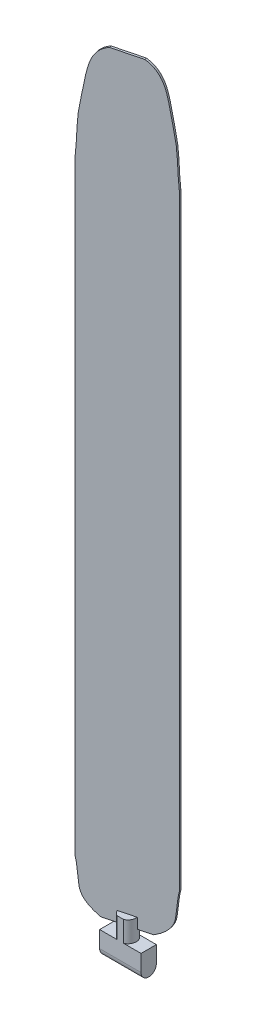
ISO-10303-21;
HEADER;
FILE_DESCRIPTION(('STEP AP214'),'2;1');
FILE_NAME('part.step','',(''),(''),'','','');
FILE_SCHEMA(('AUTOMOTIVE_DESIGN { 1 0 10303 214 1 1 1 1 }'));
ENDSEC;
DATA;
#1=APPLICATION_CONTEXT('core data for automotive mechanical design processes');
#2=APPLICATION_PROTOCOL_DEFINITION('international standard','automotive_design',2000,#1);
#3=PRODUCT_CONTEXT('',#1,'mechanical');
#4=PRODUCT('Part','Part','',(#3));
#5=PRODUCT_RELATED_PRODUCT_CATEGORY('part','',(#4));
#6=PRODUCT_DEFINITION_FORMATION('','',#4);
#7=PRODUCT_DEFINITION_CONTEXT('part definition',#1,'design');
#8=PRODUCT_DEFINITION('design','',#6,#7);
#9=PRODUCT_DEFINITION_SHAPE('','',#8);
#10=(LENGTH_UNIT() NAMED_UNIT(*) SI_UNIT(.MILLI.,.METRE.));
#11=(NAMED_UNIT(*) PLANE_ANGLE_UNIT() SI_UNIT($,.RADIAN.));
#12=(NAMED_UNIT(*) SI_UNIT($,.STERADIAN.) SOLID_ANGLE_UNIT());
#13=UNCERTAINTY_MEASURE_WITH_UNIT(LENGTH_MEASURE(1.E-05),#10,'distance_accuracy_value','');
#14=(GEOMETRIC_REPRESENTATION_CONTEXT(3) GLOBAL_UNCERTAINTY_ASSIGNED_CONTEXT((#13)) GLOBAL_UNIT_ASSIGNED_CONTEXT((#10,
#11,#12)) REPRESENTATION_CONTEXT('',''));
#15=CARTESIAN_POINT('',(0.,0.,0.));
#16=DIRECTION('',(0.,0.,1.));
#17=DIRECTION('',(1.,0.,0.));
#18=AXIS2_PLACEMENT_3D('',#15,#16,#17);
#19=CARTESIAN_POINT('',(-9.22789943202163,76.5175024074727,26.2388194762777));
#20=DIRECTION('',(0.248470646512677,0.,0.968639426113542));
#21=DIRECTION('',(0.968639426113542,0.,-0.248470646512677));
#22=AXIS2_PLACEMENT_3D('',#19,#20,#21);
#23=PLANE('',#22);
#24=CARTESIAN_POINT('',(-39.4032494334501,76.5175024074727,33.9792526255705));
#25=CARTESIAN_POINT('',(-42.2544679307018,78.055965616335,34.7106332448826));
#26=CARTESIAN_POINT('',(-47.1455859026863,81.6398276224077,35.9652788972332));
#27=CARTESIAN_POINT('',(-49.325736383886,96.7002340279113,36.5245204322718));
#28=CARTESIAN_POINT('',(-48.0147271567533,110.118902786004,36.1882267594479));
#29=CARTESIAN_POINT('',(-68.1428359658695,100.301631033117,41.3513907542741));
#30=B_SPLINE_CURVE_WITH_KNOTS('',3,(#24,#25,#26,#27,#28,#29),.UNSPECIFIED.,.F.,.F.,(4,1,1,4),
(0.,0.237372493603984,0.354242691382923,1.),.UNSPECIFIED.);
#31=CARTESIAN_POINT('',(-39.4032494334501,76.5175024074727,33.9792526255705));
#32=VERTEX_POINT('',#31);
#33=CARTESIAN_POINT('',(-49.2278994320217,98.1796978103091,36.4994237760474));
#34=VERTEX_POINT('',#33);
#35=EDGE_CURVE('E170',#32,#34,#30,.T.);
#36=ORIENTED_EDGE('',*,*,#35,.F.);
#37=DIRECTION('',(0.968639426113542,0.,-0.248470646512677));
#38=VECTOR('',#37,1.);
#39=CARTESIAN_POINT('',(-9.22789943202163,76.5175024074727,26.2388194762777));
#40=LINE('',#39,#38);
#41=CARTESIAN_POINT('',(-33.0720679794048,76.5175024074727,32.3552089343205));
#42=VERTEX_POINT('',#41);
#43=EDGE_CURVE('E426',#32,#42,#40,.T.);
#44=ORIENTED_EDGE('',*,*,#43,.T.);
#45=DIRECTION('',(0.,-1.,0.));
#46=VECTOR('',#45,1.);
#47=CARTESIAN_POINT('',(-33.0720679794048,81.5175024074727,32.3552089343205));
#48=LINE('',#47,#46);
#49=CARTESIAN_POINT('',(-33.0720679794048,81.5175024074727,32.3552089343205));
#50=VERTEX_POINT('',#49);
#51=EDGE_CURVE('E205',#50,#42,#48,.T.);
#52=ORIENTED_EDGE('',*,*,#51,.F.);
#53=DIRECTION('',(0.968639426113542,0.,-0.248470646512677));
#54=VECTOR('',#53,1.);
#55=CARTESIAN_POINT('',(-44.923581978201,81.5175024074727,35.3953013216912));
#56=LINE('',#55,#54);
#57=CARTESIAN_POINT('',(-25.3837308846385,81.5175024074727,30.3830343180046));
#58=VERTEX_POINT('',#57);
#59=EDGE_CURVE('E253',#50,#58,#56,.T.);
#60=ORIENTED_EDGE('',*,*,#59,.T.);
#61=DIRECTION('',(0.,-1.,0.));
#62=VECTOR('',#61,1.);
#63=CARTESIAN_POINT('',(-25.3837308846385,81.5175024074727,30.3830343180046));
#64=LINE('',#63,#62);
#65=CARTESIAN_POINT('',(-25.3837308846385,76.5175024074727,30.3830343180046));
#66=VERTEX_POINT('',#65);
#67=EDGE_CURVE('E208',#66,#58,#64,.F.);
#68=ORIENTED_EDGE('',*,*,#67,.F.);
#69=CARTESIAN_POINT('',(-19.0525494305926,76.5175024074727,28.7589906267544));
#70=VERTEX_POINT('',#69);
#71=EDGE_CURVE('E424',#66,#70,#40,.T.);
#72=ORIENTED_EDGE('',*,*,#71,.T.);
#73=CARTESIAN_POINT('',(-19.0525494305931,76.5175024074727,28.7589906267545));
#74=CARTESIAN_POINT('',(-16.2013309333414,78.055965616335,28.0276100074424));
#75=CARTESIAN_POINT('',(-11.3102129613569,81.6398276224077,26.7729643550918));
#76=CARTESIAN_POINT('',(-9.13006248015724,96.7002340279113,26.2137228200533));
#77=CARTESIAN_POINT('',(-10.4410717072898,110.118902786004,26.5500164928771));
#78=CARTESIAN_POINT('',(9.68703710182626,100.301631033117,21.3868524980509));
#79=B_SPLINE_CURVE_WITH_KNOTS('',3,(#73,#74,#75,#76,#77,#78),.UNSPECIFIED.,.F.,.F.,(4,1,1,4),
(0.,0.237372493603984,0.354242691382923,1.),.UNSPECIFIED.);
#80=CARTESIAN_POINT('',(-9.22789943202163,98.1796978103093,26.2388194762777));
#81=VERTEX_POINT('',#80);
#82=EDGE_CURVE('E282',#70,#81,#79,.T.);
#83=ORIENTED_EDGE('',*,*,#82,.T.);
#84=DIRECTION('',(0.,1.,0.));
#85=VECTOR('',#84,1.);
#86=CARTESIAN_POINT('',(-9.22789943202163,76.5175024074727,26.2388194762777));
#87=LINE('',#86,#85);
#88=CARTESIAN_POINT('',(-9.22789943202163,391.692905165415,26.2388194762777));
#89=VERTEX_POINT('',#88);
#90=EDGE_CURVE('E194',#81,#89,#87,.T.);
#91=ORIENTED_EDGE('',*,*,#90,.T.);
#92=CARTESIAN_POINT('',(-22.4734075021756,441.517502407473,29.6364924027091));
#93=CARTESIAN_POINT('',(-14.5906004465754,438.230583610108,27.6144333034854));
#94=CARTESIAN_POINT('',(-13.2737519900424,425.112937890694,27.2766417801042));
#95=CARTESIAN_POINT('',(-8.66340105974158,403.698342108845,26.0940171156319));
#96=CARTESIAN_POINT('',(-10.6080017756583,388.609679434815,26.5928365773087));
#97=CARTESIAN_POINT('',(-5.85636432012996,378.744136091539,25.3739697846302));
#98=B_SPLINE_CURVE_WITH_KNOTS('',3,(#92,#93,#94,#95,#96,#97),.UNSPECIFIED.,.F.,.F.,(4,1,1,4),
(0.,0.351967415580605,0.52313711086821,1.),.UNSPECIFIED.);
#99=CARTESIAN_POINT('',(-22.4734075021753,441.517502407473,29.636492402709));
#100=VERTEX_POINT('',#99);
#101=EDGE_CURVE('E277',#100,#89,#98,.T.);
#102=ORIENTED_EDGE('',*,*,#101,.F.);
#103=DIRECTION('',(0.968639426113542,0.,-0.248470646512677));
#104=VECTOR('',#103,1.);
#105=CARTESIAN_POINT('',(-9.22789943202163,441.517502407473,26.2388194762777));
#106=LINE('',#105,#104);
#107=CARTESIAN_POINT('',(-35.9823913618677,441.517502407473,33.101750849616));
#108=VERTEX_POINT('',#107);
#109=EDGE_CURVE('E428',#108,#100,#106,.T.);
#110=ORIENTED_EDGE('',*,*,#109,.F.);
#111=CARTESIAN_POINT('',(-35.9823913618677,441.517502407473,33.101750849616));
#112=CARTESIAN_POINT('',(-43.8651984174679,438.230583610108,35.1238099488397));
#113=CARTESIAN_POINT('',(-45.1820468740009,425.112937890694,35.4616014722208));
#114=CARTESIAN_POINT('',(-49.7923978043017,403.698342108845,36.6442261366931));
#115=CARTESIAN_POINT('',(-47.8477970883849,388.609679434815,36.1454066750164));
#116=CARTESIAN_POINT('',(-52.5994345439133,378.744136091539,37.3642734676949));
#117=B_SPLINE_CURVE_WITH_KNOTS('',3,(#111,#112,#113,#114,#115,#116),.UNSPECIFIED.,.F.,.F.,(4,1,
1,4),(0.,0.351967415580605,0.52313711086821,1.),.UNSPECIFIED.);
#118=CARTESIAN_POINT('',(-49.2278994320217,391.692905165415,36.4994237760474));
#119=VERTEX_POINT('',#118);
#120=EDGE_CURVE('E433',#108,#119,#117,.T.);
#121=ORIENTED_EDGE('',*,*,#120,.T.);
#122=DIRECTION('',(0.,1.,0.));
#123=VECTOR('',#122,1.);
#124=CARTESIAN_POINT('',(-49.2278994320217,76.5175024074727,36.4994237760474));
#125=LINE('',#124,#123);
#126=EDGE_CURVE('E189',#34,#119,#125,.T.);
#127=ORIENTED_EDGE('',*,*,#126,.F.);
#128=EDGE_LOOP('',(#36,#44,#52,#60,#68,#72,#83,#91,#102,#110,#121,#127));
#129=FACE_BOUND('',#128,.T.);
#130=ADVANCED_FACE('F33',(#129),#23,.T.);
#131=CARTESIAN_POINT('',(-49.4763700785343,76.5175024074727,35.5307843499338));
#132=DIRECTION('',(-0.248470646512674,0.,-0.968639426113543));
#133=DIRECTION('',(-0.968639426113543,0.,0.248470646512674));
#134=AXIS2_PLACEMENT_3D('',#131,#132,#133);
#135=PLANE('',#134);
#136=CARTESIAN_POINT('',(-39.6517200799627,76.5175024074727,33.0106131994569));
#137=CARTESIAN_POINT('',(-42.5029385772145,78.055965616335,33.7419938187691));
#138=CARTESIAN_POINT('',(-47.394056549199,81.6398276224077,34.9966394711197));
#139=CARTESIAN_POINT('',(-49.5742070303987,96.7002340279113,35.5558810061582));
#140=CARTESIAN_POINT('',(-48.263197803266,110.118902786004,35.2195873333344));
#141=CARTESIAN_POINT('',(-68.3913066123821,100.301631033117,40.3827513281606));
#142=B_SPLINE_CURVE_WITH_KNOTS('',3,(#136,#137,#138,#139,#140,#141),.UNSPECIFIED.,.F.,.F.,(4,1,
1,4),(0.,0.237372493603984,0.354242691382923,1.),.UNSPECIFIED.);
#143=CARTESIAN_POINT('',(-49.4763700785343,98.1796978103091,35.5307843499338));
#144=VERTEX_POINT('',#143);
#145=CARTESIAN_POINT('',(-39.6517200799627,76.5175024074727,33.010613199457));
#146=VERTEX_POINT('',#145);
#147=EDGE_CURVE('E47',#144,#146,#142,.F.);
#148=ORIENTED_EDGE('',*,*,#147,.F.);
#149=DIRECTION('',(0.,1.,0.));
#150=VECTOR('',#149,1.);
#151=CARTESIAN_POINT('',(-49.4763700785343,76.5175024074727,35.5307843499338));
#152=LINE('',#151,#150);
#153=CARTESIAN_POINT('',(-49.4763700785343,391.692905165415,35.5307843499338));
#154=VERTEX_POINT('',#153);
#155=EDGE_CURVE('E179',#144,#154,#152,.T.);
#156=ORIENTED_EDGE('',*,*,#155,.T.);
#157=CARTESIAN_POINT('',(-36.2308620083804,441.517502407473,32.1331114235024));
#158=CARTESIAN_POINT('',(-44.1136690639806,438.230583610108,34.1551705227261));
#159=CARTESIAN_POINT('',(-45.4305175205135,425.112937890694,34.4929620461073));
#160=CARTESIAN_POINT('',(-50.0408684508144,403.698342108845,35.6755867105796));
#161=CARTESIAN_POINT('',(-48.0962677348976,388.609679434815,35.1767672489028));
#162=CARTESIAN_POINT('',(-52.847905190426,378.744136091539,36.3956340415813));
#163=B_SPLINE_CURVE_WITH_KNOTS('',3,(#157,#158,#159,#160,#161,#162),.UNSPECIFIED.,.F.,.F.,(4,1,
1,4),(0.,0.351967415580605,0.52313711086821,1.),.UNSPECIFIED.);
#164=CARTESIAN_POINT('',(-36.2308620083808,441.517502407473,32.1331114235026));
#165=VERTEX_POINT('',#164);
#166=EDGE_CURVE('E437',#154,#165,#163,.F.);
#167=ORIENTED_EDGE('',*,*,#166,.T.);
#168=DIRECTION('',(-0.968639426113543,0.,0.248470646512674));
#169=VECTOR('',#168,1.);
#170=CARTESIAN_POINT('',(-49.4763700785343,441.517502407473,35.5307843499338));
#171=LINE('',#170,#169);
#172=CARTESIAN_POINT('',(-22.7218781486879,441.517502407473,28.6678529765955));
#173=VERTEX_POINT('',#172);
#174=EDGE_CURVE('E274',#173,#165,#171,.T.);
#175=ORIENTED_EDGE('',*,*,#174,.F.);
#176=CARTESIAN_POINT('',(-22.7218781486883,441.517502407473,28.6678529765955));
#177=CARTESIAN_POINT('',(-14.8390710930881,438.230583610108,26.6457938773719));
#178=CARTESIAN_POINT('',(-13.5222226365551,425.112937890694,26.3080023539907));
#179=CARTESIAN_POINT('',(-8.91187170625425,403.698342108845,25.1253776895184));
#180=CARTESIAN_POINT('',(-10.856472422171,388.609679434815,25.6241971511952));
#181=CARTESIAN_POINT('',(-6.10483496664264,378.744136091539,24.4053303585166));
#182=B_SPLINE_CURVE_WITH_KNOTS('',3,(#176,#177,#178,#179,#180,#181),.UNSPECIFIED.,.F.,.F.,(4,1,
1,4),(0.,0.351967415580605,0.52313711086821,1.),.UNSPECIFIED.);
#183=CARTESIAN_POINT('',(-9.47637007853427,391.692905165415,25.2701800501642));
#184=VERTEX_POINT('',#183);
#185=EDGE_CURVE('E273',#184,#173,#182,.F.);
#186=ORIENTED_EDGE('',*,*,#185,.F.);
#187=DIRECTION('',(0.,1.,0.));
#188=VECTOR('',#187,1.);
#189=CARTESIAN_POINT('',(-9.47637007853427,76.5175024074727,25.2701800501642));
#190=LINE('',#189,#188);
#191=CARTESIAN_POINT('',(-9.47637007853427,98.1796978103089,25.2701800501642));
#192=VERTEX_POINT('',#191);
#193=EDGE_CURVE('E190',#192,#184,#190,.T.);
#194=ORIENTED_EDGE('',*,*,#193,.F.);
#195=CARTESIAN_POINT('',(-19.3010200771058,76.5175024074727,27.790351200641));
#196=CARTESIAN_POINT('',(-16.4498015798541,78.055965616335,27.0589705813289));
#197=CARTESIAN_POINT('',(-11.5586836078696,81.6398276224077,25.8043249289783));
#198=CARTESIAN_POINT('',(-9.37853312666991,96.7002340279113,25.2450833939397));
#199=CARTESIAN_POINT('',(-10.6895423538025,110.118902786004,25.5813770667636));
#200=CARTESIAN_POINT('',(9.43856645531359,100.301631033117,20.4182130719374));
#201=B_SPLINE_CURVE_WITH_KNOTS('',3,(#195,#196,#197,#198,#199,#200),.UNSPECIFIED.,.F.,.F.,(4,1,
1,4),(0.,0.237372493603984,0.354242691382923,1.),.UNSPECIFIED.);
#202=CARTESIAN_POINT('',(-19.3010200771053,76.5175024074727,27.790351200641));
#203=VERTEX_POINT('',#202);
#204=EDGE_CURVE('E55',#192,#203,#201,.F.);
#205=ORIENTED_EDGE('',*,*,#204,.T.);
#206=DIRECTION('',(-0.968639426113543,0.,0.248470646512674));
#207=VECTOR('',#206,1.);
#208=CARTESIAN_POINT('',(-49.4763700785343,76.5175024074727,35.5307843499338));
#209=LINE('',#208,#207);
#210=CARTESIAN_POINT('',(-25.6322015311511,76.5175024074727,29.4143948918911));
#211=VERTEX_POINT('',#210);
#212=EDGE_CURVE('E199',#203,#211,#209,.T.);
#213=ORIENTED_EDGE('',*,*,#212,.T.);
#214=DIRECTION('',(0.,-1.,0.));
#215=VECTOR('',#214,1.);
#216=CARTESIAN_POINT('',(-25.6322015311511,81.5175024074727,29.4143948918911));
#217=LINE('',#216,#215);
#218=CARTESIAN_POINT('',(-25.6322015311511,81.5175024074727,29.4143948918911));
#219=VERTEX_POINT('',#218);
#220=EDGE_CURVE('E202',#219,#211,#217,.T.);
#221=ORIENTED_EDGE('',*,*,#220,.F.);
#222=DIRECTION('',(-0.968639426113543,0.,0.248470646512674));
#223=VECTOR('',#222,1.);
#224=CARTESIAN_POINT('',(-45.1720526247137,81.5175024074727,34.4266618955777));
#225=LINE('',#224,#223);
#226=CARTESIAN_POINT('',(-33.3205386259175,81.5175024074727,31.386569508207));
#227=VERTEX_POINT('',#226);
#228=EDGE_CURVE('E250',#219,#227,#225,.T.);
#229=ORIENTED_EDGE('',*,*,#228,.T.);
#230=DIRECTION('',(0.,-1.,0.));
#231=VECTOR('',#230,1.);
#232=CARTESIAN_POINT('',(-33.3205386259175,81.5175024074727,31.386569508207));
#233=LINE('',#232,#231);
#234=CARTESIAN_POINT('',(-33.3205386259175,76.5175024074727,31.386569508207));
#235=VERTEX_POINT('',#234);
#236=EDGE_CURVE('E192',#235,#227,#233,.F.);
#237=ORIENTED_EDGE('',*,*,#236,.F.);
#238=EDGE_CURVE('E183',#235,#146,#209,.T.);
#239=ORIENTED_EDGE('',*,*,#238,.T.);
#240=EDGE_LOOP('',(#148,#156,#167,#175,#186,#194,#205,#213,#221,#229,#237,#239));
#241=FACE_BOUND('',#240,.T.);
#242=ADVANCED_FACE('F177',(#241),#135,.T.);
#243=CARTESIAN_POINT('',(-49.2278994320217,76.5175024074727,36.4994237760474));
#244=DIRECTION('',(0.,-1.,0.));
#245=DIRECTION('',(0.,0.,-1.));
#246=AXIS2_PLACEMENT_3D('',#243,#244,#245);
#247=PLANE('',#246);
#248=ORIENTED_EDGE('',*,*,#212,.F.);
#249=DIRECTION('',(0.248470646512677,0.,0.968639426113542));
#250=VECTOR('',#249,1.);
#251=CARTESIAN_POINT('',(-21.7705265642424,76.5175024074727,18.163212622877));
#252=LINE('',#251,#250);
#253=EDGE_CURVE('E425',#203,#70,#252,.T.);
#254=ORIENTED_EDGE('',*,*,#253,.T.);
#255=ORIENTED_EDGE('',*,*,#71,.F.);
#256=CARTESIAN_POINT('',(-29.352134755278,76.5175024074727,30.8848019131057));
#257=DIRECTION('',(0.,-1.,0.));
#258=DIRECTION('',(0.,0.,-1.));
#259=AXIS2_PLACEMENT_3D('',#256,#257,#258);
#260=CIRCLE('',#259,4.);
#261=EDGE_CURVE('E210',#211,#66,#260,.T.);
#262=ORIENTED_EDGE('',*,*,#261,.F.);
#263=EDGE_LOOP('',(#248,#254,#255,#262));
#264=FACE_BOUND('',#263,.T.);
#265=ADVANCED_FACE('F318',(#264),#247,.T.);
#266=CARTESIAN_POINT('',(-9.47637007853427,76.5175024074727,25.2701800501642));
#267=DIRECTION('',(0.968639426113543,0.,-0.248470646512674));
#268=DIRECTION('',(-0.248470646512674,0.,-0.968639426113543));
#269=AXIS2_PLACEMENT_3D('',#266,#267,#268);
#270=PLANE('',#269);
#271=ORIENTED_EDGE('',*,*,#90,.F.);
#272=DIRECTION('',(0.248470646512677,0.,0.968639426113542));
#273=VECTOR('',#272,1.);
#274=CARTESIAN_POINT('',(-11.9458765656713,98.1796978103089,15.6430414724003));
#275=LINE('',#274,#273);
#276=EDGE_CURVE('E41',#81,#192,#275,.F.);
#277=ORIENTED_EDGE('',*,*,#276,.T.);
#278=ORIENTED_EDGE('',*,*,#193,.T.);
#279=DIRECTION('',(0.248470646512677,0.,0.968639426113542));
#280=VECTOR('',#279,1.);
#281=CARTESIAN_POINT('',(-11.9458765656713,391.692905165415,15.6430414724003));
#282=LINE('',#281,#280);
#283=EDGE_CURVE('E262',#89,#184,#282,.F.);
#284=ORIENTED_EDGE('',*,*,#283,.F.);
#285=EDGE_LOOP('',(#271,#277,#278,#284));
#286=FACE_BOUND('',#285,.T.);
#287=ADVANCED_FACE('F267',(#286),#270,.T.);
#288=CARTESIAN_POINT('',(-49.2278994320217,76.5175024074727,36.4994237760474));
#289=DIRECTION('',(-0.968639426113542,0.,0.248470646512678));
#290=DIRECTION('',(0.248470646512678,0.,0.968639426113542));
#291=AXIS2_PLACEMENT_3D('',#288,#289,#290);
#292=PLANE('',#291);
#293=DIRECTION('',(0.248470646512677,0.,0.968639426113542));
#294=VECTOR('',#293,1.);
#295=CARTESIAN_POINT('',(-51.9458765656714,98.1796978103091,25.90364577217));
#296=LINE('',#295,#294);
#297=EDGE_CURVE('E167',#144,#34,#296,.T.);
#298=ORIENTED_EDGE('',*,*,#297,.T.);
#299=ORIENTED_EDGE('',*,*,#126,.T.);
#300=DIRECTION('',(0.248470646512677,0.,0.968639426113542));
#301=VECTOR('',#300,1.);
#302=CARTESIAN_POINT('',(-51.9458765656714,391.692905165415,25.9036457721699));
#303=LINE('',#302,#301);
#304=EDGE_CURVE('E188',#154,#119,#303,.T.);
#305=ORIENTED_EDGE('',*,*,#304,.F.);
#306=ORIENTED_EDGE('',*,*,#155,.F.);
#307=EDGE_LOOP('',(#298,#299,#305,#306));
#308=FACE_BOUND('',#307,.T.);
#309=ADVANCED_FACE('F186',(#308),#292,.T.);
#310=CARTESIAN_POINT('',(-49.2278994320217,441.517502407473,36.4994237760474));
#311=DIRECTION('',(0.,-1.,0.));
#312=DIRECTION('',(0.,0.,-1.));
#313=AXIS2_PLACEMENT_3D('',#310,#311,#312);
#314=PLANE('',#313);
#315=ORIENTED_EDGE('',*,*,#109,.T.);
#316=DIRECTION('',(0.248470646512677,0.,0.968639426113542));
#317=VECTOR('',#316,1.);
#318=CARTESIAN_POINT('',(-25.191384635825,441.517502407473,19.0407143988316));
#319=LINE('',#318,#317);
#320=EDGE_CURVE('E278',#173,#100,#319,.T.);
#321=ORIENTED_EDGE('',*,*,#320,.F.);
#322=ORIENTED_EDGE('',*,*,#174,.T.);
#323=DIRECTION('',(0.248470646512677,0.,0.968639426113542));
#324=VECTOR('',#323,1.);
#325=CARTESIAN_POINT('',(-38.7003684955174,441.517502407473,22.5059728457386));
#326=LINE('',#325,#324);
#327=EDGE_CURVE('E259',#108,#165,#326,.F.);
#328=ORIENTED_EDGE('',*,*,#327,.F.);
#329=EDGE_LOOP('',(#315,#321,#322,#328));
#330=FACE_BOUND('',#329,.T.);
#331=ADVANCED_FACE('F313',(#330),#314,.F.);
#332=CARTESIAN_POINT('',(-46.080593218847,81.5175024074727,30.8848019131057));
#333=DIRECTION('',(0.,1.,0.));
#334=DIRECTION('',(0.,0.,1.));
#335=AXIS2_PLACEMENT_3D('',#332,#333,#334);
#336=PLANE('',#335);
#337=ORIENTED_EDGE('',*,*,#59,.F.);
#338=CARTESIAN_POINT('',(-29.352134755278,81.5175024074727,30.8848019131057));
#339=DIRECTION('',(0.,1.,0.));
#340=DIRECTION('',(0.,0.,1.));
#341=AXIS2_PLACEMENT_3D('',#338,#339,#340);
#342=CIRCLE('',#341,4.);
#343=CARTESIAN_POINT('',(-30.8720031706351,81.5175024074727,34.5848019131057));
#344=VERTEX_POINT('',#343);
#345=EDGE_CURVE('E222',#50,#344,#342,.T.);
#346=ORIENTED_EDGE('',*,*,#345,.T.);
#347=DIRECTION('',(1.,0.,0.));
#348=VECTOR('',#347,1.);
#349=CARTESIAN_POINT('',(-46.080593218847,81.5175024074727,34.5848019131057));
#350=LINE('',#349,#348);
#351=CARTESIAN_POINT('',(-27.8322663399209,81.5175024074727,34.5848019131057));
#352=VERTEX_POINT('',#351);
#353=EDGE_CURVE('E213',#344,#352,#350,.T.);
#354=ORIENTED_EDGE('',*,*,#353,.T.);
#355=EDGE_CURVE('E218',#352,#58,#342,.T.);
#356=ORIENTED_EDGE('',*,*,#355,.T.);
#357=EDGE_LOOP('',(#337,#346,#354,#356));
#358=FACE_BOUND('',#357,.T.);
#359=ADVANCED_FACE('F316',(#358),#336,.T.);
#360=CARTESIAN_POINT('',(-19.352134755278,71.5175024074727,34.5848019131057));
#361=DIRECTION('',(0.,-1.,0.));
#362=DIRECTION('',(0.,0.,-1.));
#363=AXIS2_PLACEMENT_3D('',#360,#361,#362);
#364=PLANE('',#363);
#365=CARTESIAN_POINT('',(-29.352134755278,71.5175024074727,30.8848019131057));
#366=DIRECTION('',(0.,1.,0.));
#367=DIRECTION('',(0.,0.,1.));
#368=AXIS2_PLACEMENT_3D('',#365,#366,#367);
#369=CIRCLE('',#368,4.);
#370=CARTESIAN_POINT('',(-30.8720031706351,71.5175024074727,27.1848019131057));
#371=VERTEX_POINT('',#370);
#372=CARTESIAN_POINT('',(-30.8720031706351,71.5175024074727,34.5848019131057));
#373=VERTEX_POINT('',#372);
#374=EDGE_CURVE('E217',#371,#373,#369,.T.);
#375=ORIENTED_EDGE('',*,*,#374,.F.);
#376=DIRECTION('',(-1.,0.,0.));
#377=VECTOR('',#376,1.);
#378=CARTESIAN_POINT('',(-19.352134755278,71.5175024074727,27.1848019131057));
#379=LINE('',#378,#377);
#380=CARTESIAN_POINT('',(-39.352134755278,71.5175024074727,27.1848019131057));
#381=VERTEX_POINT('',#380);
#382=EDGE_CURVE('E369',#371,#381,#379,.T.);
#383=ORIENTED_EDGE('',*,*,#382,.T.);
#384=DIRECTION('',(0.,0.,1.));
#385=VECTOR('',#384,1.);
#386=CARTESIAN_POINT('',(-39.352134755278,71.5175024074727,34.5848019131057));
#387=LINE('',#386,#385);
#388=CARTESIAN_POINT('',(-39.352134755278,71.5175024074727,34.5848019131057));
#389=VERTEX_POINT('',#388);
#390=EDGE_CURVE('E373',#381,#389,#387,.T.);
#391=ORIENTED_EDGE('',*,*,#390,.T.);
#392=DIRECTION('',(-1.,0.,0.));
#393=VECTOR('',#392,1.);
#394=CARTESIAN_POINT('',(-19.352134755278,71.5175024074727,34.5848019131057));
#395=LINE('',#394,#393);
#396=EDGE_CURVE('E386',#373,#389,#395,.T.);
#397=ORIENTED_EDGE('',*,*,#396,.F.);
#398=EDGE_LOOP('',(#375,#383,#391,#397));
#399=FACE_BOUND('',#398,.T.);
#400=ADVANCED_FACE('F353',(#399),#364,.F.);
#401=CARTESIAN_POINT('',(-27.8322663399209,71.5175024074727,34.5848019131057));
#402=VERTEX_POINT('',#401);
#403=CARTESIAN_POINT('',(-27.8322663399209,71.5175024074727,27.1848019131057));
#404=VERTEX_POINT('',#403);
#405=EDGE_CURVE('E212',#402,#404,#369,.T.);
#406=ORIENTED_EDGE('',*,*,#405,.F.);
#407=CARTESIAN_POINT('',(-19.352134755278,71.5175024074727,34.5848019131057));
#408=VERTEX_POINT('',#407);
#409=EDGE_CURVE('E396',#408,#402,#395,.T.);
#410=ORIENTED_EDGE('',*,*,#409,.F.);
#411=DIRECTION('',(0.,0.,1.));
#412=VECTOR('',#411,1.);
#413=CARTESIAN_POINT('',(-19.352134755278,71.5175024074727,34.5848019131057));
#414=LINE('',#413,#412);
#415=CARTESIAN_POINT('',(-19.352134755278,71.5175024074727,27.1848019131057));
#416=VERTEX_POINT('',#415);
#417=EDGE_CURVE('E654',#416,#408,#414,.T.);
#418=ORIENTED_EDGE('',*,*,#417,.F.);
#419=EDGE_CURVE('E398',#416,#404,#379,.T.);
#420=ORIENTED_EDGE('',*,*,#419,.T.);
#421=EDGE_LOOP('',(#406,#410,#418,#420));
#422=FACE_BOUND('',#421,.T.);
#423=ADVANCED_FACE('F355',(#422),#364,.F.);
#424=CARTESIAN_POINT('',(-19.352134755278,63.5175024074727,30.8848019131057));
#425=DIRECTION('',(-1.,0.,0.));
#426=DIRECTION('',(0.,0.,1.));
#427=AXIS2_PLACEMENT_3D('',#424,#425,#426);
#428=CYLINDRICAL_SURFACE('',#427,3.69999999999999);
#429=CARTESIAN_POINT('',(-39.352134755278,63.5175024074727,30.8848019131057));
#430=DIRECTION('',(1.,0.,0.));
#431=DIRECTION('',(0.,0.,-1.));
#432=AXIS2_PLACEMENT_3D('',#429,#430,#431);
#433=CIRCLE('',#432,3.69999999999999);
#434=CARTESIAN_POINT('',(-39.352134755278,63.5175024074727,34.5848019131057));
#435=VERTEX_POINT('',#434);
#436=CARTESIAN_POINT('',(-39.352134755278,63.5175024074727,27.1848019131057));
#437=VERTEX_POINT('',#436);
#438=EDGE_CURVE('E374',#435,#437,#433,.T.);
#439=ORIENTED_EDGE('',*,*,#438,.T.);
#440=DIRECTION('',(-1.,0.,0.));
#441=VECTOR('',#440,1.);
#442=CARTESIAN_POINT('',(-19.352134755278,63.5175024074727,27.1848019131057));
#443=LINE('',#442,#441);
#444=CARTESIAN_POINT('',(-19.352134755278,63.5175024074727,27.1848019131057));
#445=VERTEX_POINT('',#444);
#446=EDGE_CURVE('E254',#445,#437,#443,.T.);
#447=ORIENTED_EDGE('',*,*,#446,.F.);
#448=CARTESIAN_POINT('',(-19.352134755278,63.5175024074727,30.8848019131057));
#449=DIRECTION('',(1.,0.,0.));
#450=DIRECTION('',(0.,0.,-1.));
#451=AXIS2_PLACEMENT_3D('',#448,#449,#450);
#452=CIRCLE('',#451,3.69999999999999);
#453=CARTESIAN_POINT('',(-19.352134755278,63.5175024074727,34.5848019131057));
#454=VERTEX_POINT('',#453);
#455=EDGE_CURVE('E227',#454,#445,#452,.T.);
#456=ORIENTED_EDGE('',*,*,#455,.F.);
#457=DIRECTION('',(-1.,0.,0.));
#458=VECTOR('',#457,1.);
#459=CARTESIAN_POINT('',(-19.352134755278,63.5175024074727,34.5848019131057));
#460=LINE('',#459,#458);
#461=EDGE_CURVE('E383',#454,#435,#460,.T.);
#462=ORIENTED_EDGE('',*,*,#461,.T.);
#463=EDGE_LOOP('',(#439,#447,#456,#462));
#464=FACE_BOUND('',#463,.T.);
#465=ADVANCED_FACE('F35',(#464),#428,.T.);
#466=CARTESIAN_POINT('',(-19.352134755278,71.5175024074727,27.1848019131057));
#467=DIRECTION('',(0.,0.,1.));
#468=DIRECTION('',(1.,0.,0.));
#469=AXIS2_PLACEMENT_3D('',#466,#467,#468);
#470=PLANE('',#469);
#471=DIRECTION('',(0.,1.,0.));
#472=VECTOR('',#471,1.);
#473=CARTESIAN_POINT('',(-39.352134755278,71.5175024074727,27.1848019131057));
#474=LINE('',#473,#472);
#475=EDGE_CURVE('E366',#437,#381,#474,.T.);
#476=ORIENTED_EDGE('',*,*,#475,.T.);
#477=ORIENTED_EDGE('',*,*,#382,.F.);
#478=DIRECTION('',(0.,-1.,0.));
#479=VECTOR('',#478,1.);
#480=CARTESIAN_POINT('',(-30.8720031706351,81.5175024074727,27.1848019131057));
#481=LINE('',#480,#479);
#482=CARTESIAN_POINT('',(-30.8720031706351,81.5175024074727,27.1848019131057));
#483=VERTEX_POINT('',#482);
#484=EDGE_CURVE('E242',#483,#371,#481,.T.);
#485=ORIENTED_EDGE('',*,*,#484,.F.);
#486=DIRECTION('',(-1.,0.,0.));
#487=VECTOR('',#486,1.);
#488=CARTESIAN_POINT('',(-46.080593218847,81.5175024074727,27.1848019131057));
#489=LINE('',#488,#487);
#490=CARTESIAN_POINT('',(-27.8322663399209,81.5175024074727,27.1848019131057));
#491=VERTEX_POINT('',#490);
#492=EDGE_CURVE('E221',#491,#483,#489,.T.);
#493=ORIENTED_EDGE('',*,*,#492,.F.);
#494=DIRECTION('',(0.,-1.,0.));
#495=VECTOR('',#494,1.);
#496=CARTESIAN_POINT('',(-27.8322663399209,81.5175024074727,27.1848019131057));
#497=LINE('',#496,#495);
#498=EDGE_CURVE('E247',#491,#404,#497,.T.);
#499=ORIENTED_EDGE('',*,*,#498,.T.);
#500=ORIENTED_EDGE('',*,*,#419,.F.);
#501=DIRECTION('',(0.,1.,0.));
#502=VECTOR('',#501,1.);
#503=CARTESIAN_POINT('',(-19.352134755278,71.5175024074727,27.1848019131057));
#504=LINE('',#503,#502);
#505=EDGE_CURVE('E655',#445,#416,#504,.T.);
#506=ORIENTED_EDGE('',*,*,#505,.F.);
#507=ORIENTED_EDGE('',*,*,#446,.T.);
#508=EDGE_LOOP('',(#476,#477,#485,#493,#499,#500,#506,#507));
#509=FACE_BOUND('',#508,.T.);
#510=ADVANCED_FACE('F351',(#509),#470,.F.);
#511=CARTESIAN_POINT('',(-19.352134755278,63.5175024074727,34.5848019131057));
#512=DIRECTION('',(0.,0.,-1.));
#513=DIRECTION('',(-1.,0.,0.));
#514=AXIS2_PLACEMENT_3D('',#511,#512,#513);
#515=PLANE('',#514);
#516=DIRECTION('',(0.,-1.,0.));
#517=VECTOR('',#516,1.);
#518=CARTESIAN_POINT('',(-39.352134755278,63.5175024074727,34.5848019131057));
#519=LINE('',#518,#517);
#520=EDGE_CURVE('E378',#389,#435,#519,.T.);
#521=ORIENTED_EDGE('',*,*,#520,.T.);
#522=ORIENTED_EDGE('',*,*,#461,.F.);
#523=DIRECTION('',(0.,-1.,0.));
#524=VECTOR('',#523,1.);
#525=CARTESIAN_POINT('',(-19.352134755278,63.5175024074727,34.5848019131057));
#526=LINE('',#525,#524);
#527=EDGE_CURVE('E387',#408,#454,#526,.T.);
#528=ORIENTED_EDGE('',*,*,#527,.F.);
#529=ORIENTED_EDGE('',*,*,#409,.T.);
#530=DIRECTION('',(0.,-1.,0.));
#531=VECTOR('',#530,1.);
#532=CARTESIAN_POINT('',(-27.8322663399209,81.5175024074727,34.5848019131057));
#533=LINE('',#532,#531);
#534=EDGE_CURVE('E409',#352,#402,#533,.T.);
#535=ORIENTED_EDGE('',*,*,#534,.F.);
#536=ORIENTED_EDGE('',*,*,#353,.F.);
#537=DIRECTION('',(0.,-1.,0.));
#538=VECTOR('',#537,1.);
#539=CARTESIAN_POINT('',(-30.8720031706351,81.5175024074727,34.5848019131057));
#540=LINE('',#539,#538);
#541=EDGE_CURVE('E239',#344,#373,#540,.T.);
#542=ORIENTED_EDGE('',*,*,#541,.T.);
#543=ORIENTED_EDGE('',*,*,#396,.T.);
#544=EDGE_LOOP('',(#521,#522,#528,#529,#535,#536,#542,#543));
#545=FACE_BOUND('',#544,.T.);
#546=ADVANCED_FACE('F344',(#545),#515,.F.);
#547=CARTESIAN_POINT('',(-19.352134755278,63.5175024074727,30.8848019131057));
#548=DIRECTION('',(1.,0.,0.));
#549=DIRECTION('',(0.,0.,-1.));
#550=AXIS2_PLACEMENT_3D('',#547,#548,#549);
#551=PLANE('',#550);
#552=ORIENTED_EDGE('',*,*,#455,.T.);
#553=ORIENTED_EDGE('',*,*,#505,.T.);
#554=ORIENTED_EDGE('',*,*,#417,.T.);
#555=ORIENTED_EDGE('',*,*,#527,.T.);
#556=EDGE_LOOP('',(#552,#553,#554,#555));
#557=FACE_BOUND('',#556,.T.);
#558=ADVANCED_FACE('F340',(#557),#551,.T.);
#559=CARTESIAN_POINT('',(-39.352134755278,63.5175024074727,30.8848019131057));
#560=DIRECTION('',(1.,0.,0.));
#561=DIRECTION('',(0.,0.,-1.));
#562=AXIS2_PLACEMENT_3D('',#559,#560,#561);
#563=PLANE('',#562);
#564=ORIENTED_EDGE('',*,*,#438,.F.);
#565=ORIENTED_EDGE('',*,*,#520,.F.);
#566=ORIENTED_EDGE('',*,*,#390,.F.);
#567=ORIENTED_EDGE('',*,*,#475,.F.);
#568=EDGE_LOOP('',(#564,#565,#566,#567));
#569=FACE_BOUND('',#568,.T.);
#570=ADVANCED_FACE('F343',(#569),#563,.F.);
#571=CARTESIAN_POINT('',(-29.352134755278,81.5175024074727,30.8848019131057));
#572=DIRECTION('',(0.,-1.,0.));
#573=DIRECTION('',(0.,0.,-1.));
#574=AXIS2_PLACEMENT_3D('',#571,#572,#573);
#575=CYLINDRICAL_SURFACE('',#574,4.);
#576=ORIENTED_EDGE('',*,*,#261,.T.);
#577=ORIENTED_EDGE('',*,*,#67,.T.);
#578=ORIENTED_EDGE('',*,*,#355,.F.);
#579=ORIENTED_EDGE('',*,*,#534,.T.);
#580=ORIENTED_EDGE('',*,*,#405,.T.);
#581=ORIENTED_EDGE('',*,*,#498,.F.);
#582=EDGE_CURVE('E216',#219,#491,#342,.T.);
#583=ORIENTED_EDGE('',*,*,#582,.F.);
#584=ORIENTED_EDGE('',*,*,#220,.T.);
#585=EDGE_LOOP('',(#576,#577,#578,#579,#580,#581,#583,#584));
#586=FACE_BOUND('',#585,.T.);
#587=ADVANCED_FACE('F338',(#586),#575,.T.);
#588=ORIENTED_EDGE('',*,*,#345,.F.);
#589=ORIENTED_EDGE('',*,*,#51,.T.);
#590=CARTESIAN_POINT('',(-29.352134755278,76.5175024074727,30.8848019131057));
#591=DIRECTION('',(0.,-1.,0.));
#592=DIRECTION('',(0.,0.,-1.));
#593=AXIS2_PLACEMENT_3D('',#590,#591,#592);
#594=CIRCLE('',#593,4.);
#595=EDGE_CURVE('E257',#42,#235,#594,.T.);
#596=ORIENTED_EDGE('',*,*,#595,.T.);
#597=ORIENTED_EDGE('',*,*,#236,.T.);
#598=EDGE_CURVE('E223',#483,#227,#342,.T.);
#599=ORIENTED_EDGE('',*,*,#598,.F.);
#600=ORIENTED_EDGE('',*,*,#484,.T.);
#601=ORIENTED_EDGE('',*,*,#374,.T.);
#602=ORIENTED_EDGE('',*,*,#541,.F.);
#603=EDGE_LOOP('',(#588,#589,#596,#597,#599,#600,#601,#602));
#604=FACE_BOUND('',#603,.T.);
#605=ADVANCED_FACE('F334',(#604),#575,.T.);
#606=ORIENTED_EDGE('',*,*,#228,.F.);
#607=ORIENTED_EDGE('',*,*,#582,.T.);
#608=ORIENTED_EDGE('',*,*,#492,.T.);
#609=ORIENTED_EDGE('',*,*,#598,.T.);
#610=EDGE_LOOP('',(#606,#607,#608,#609));
#611=FACE_BOUND('',#610,.T.);
#612=ADVANCED_FACE('F331',(#611),#336,.T.);
#613=DIRECTION('',(0.248470646512677,0.,0.968639426113542));
#614=VECTOR('',#613,1.);
#615=CARTESIAN_POINT('',(-42.1212265670998,76.5175024074727,23.3834746216931));
#616=LINE('',#615,#614);
#617=EDGE_CURVE('E11',#146,#32,#616,.T.);
#618=ORIENTED_EDGE('',*,*,#617,.F.);
#619=ORIENTED_EDGE('',*,*,#238,.F.);
#620=ORIENTED_EDGE('',*,*,#595,.F.);
#621=ORIENTED_EDGE('',*,*,#43,.F.);
#622=EDGE_LOOP('',(#618,#619,#620,#621));
#623=FACE_BOUND('',#622,.T.);
#624=ADVANCED_FACE('F310',(#623),#247,.T.);
#625=CARTESIAN_POINT('',(-38.7003684955174,441.517502407473,22.5059728457386));
#626=CARTESIAN_POINT('',(-46.5831755511176,438.230583610108,24.5280319449623));
#627=CARTESIAN_POINT('',(-47.9000240076506,425.112937890694,24.8658234683435));
#628=CARTESIAN_POINT('',(-52.5103749379514,403.698342108845,26.0484481328158));
#629=CARTESIAN_POINT('',(-50.5657742220347,388.609679434815,25.549628671139));
#630=CARTESIAN_POINT('',(-55.317411677563,378.744136091539,26.7684954638175));
#631=B_SPLINE_CURVE_WITH_KNOTS('',3,(#625,#626,#627,#628,#629,#630),.UNSPECIFIED.,.F.,.F.,(4,1,
1,4),(0.,0.351967415580605,0.52313711086821,1.),.UNSPECIFIED.);
#632=DIRECTION('',(0.248470646512677,0.,0.968639426113542));
#633=VECTOR('',#632,1.);
#634=SURFACE_OF_LINEAR_EXTRUSION('',#631,#633);
#635=ORIENTED_EDGE('',*,*,#327,.T.);
#636=ORIENTED_EDGE('',*,*,#166,.F.);
#637=ORIENTED_EDGE('',*,*,#304,.T.);
#638=ORIENTED_EDGE('',*,*,#120,.F.);
#639=EDGE_LOOP('',(#635,#636,#637,#638));
#640=FACE_BOUND('',#639,.T.);
#641=ADVANCED_FACE('F305',(#640),#634,.T.);
#642=CARTESIAN_POINT('',(-25.1913846358253,441.517502407473,19.0407143988317));
#643=CARTESIAN_POINT('',(-17.3085775802251,438.230583610108,17.018655299608));
#644=CARTESIAN_POINT('',(-15.9917291236922,425.112937890694,16.6808637762268));
#645=CARTESIAN_POINT('',(-11.3813781933913,403.698342108845,15.4982391117545));
#646=CARTESIAN_POINT('',(-13.3259789093081,388.609679434815,15.9970585734313));
#647=CARTESIAN_POINT('',(-8.57434145377971,378.744136091539,14.7781917807528));
#648=B_SPLINE_CURVE_WITH_KNOTS('',3,(#642,#643,#644,#645,#646,#647),.UNSPECIFIED.,.F.,.F.,(4,1,
1,4),(0.,0.351967415580605,0.52313711086821,1.),.UNSPECIFIED.);
#649=DIRECTION('',(0.248470646512677,0.,0.968639426113542));
#650=VECTOR('',#649,1.);
#651=SURFACE_OF_LINEAR_EXTRUSION('',#648,#650);
#652=ORIENTED_EDGE('',*,*,#101,.T.);
#653=ORIENTED_EDGE('',*,*,#283,.T.);
#654=ORIENTED_EDGE('',*,*,#185,.T.);
#655=ORIENTED_EDGE('',*,*,#320,.T.);
#656=EDGE_LOOP('',(#652,#653,#654,#655));
#657=FACE_BOUND('',#656,.T.);
#658=ADVANCED_FACE('F309',(#657),#651,.F.);
#659=CARTESIAN_POINT('',(-21.7705265642429,76.5175024074727,18.1632126228771));
#660=CARTESIAN_POINT('',(-18.9193080669911,78.055965616335,17.4318320035651));
#661=CARTESIAN_POINT('',(-14.0281900950066,81.6398276224077,16.1771863512144));
#662=CARTESIAN_POINT('',(-11.848039613807,96.7002340279113,15.6179448161759));
#663=CARTESIAN_POINT('',(-13.1590488409396,110.118902786004,15.9542384889997));
#664=CARTESIAN_POINT('',(6.96905996817652,100.301631033117,10.7910744941735));
#665=B_SPLINE_CURVE_WITH_KNOTS('',3,(#659,#660,#661,#662,#663,#664),.UNSPECIFIED.,.F.,.F.,(4,1,
1,4),(0.,0.237372493603984,0.354242691382923,1.),.UNSPECIFIED.);
#666=DIRECTION('',(0.248470646512677,0.,0.968639426113542));
#667=VECTOR('',#666,1.);
#668=SURFACE_OF_LINEAR_EXTRUSION('',#665,#667);
#669=ORIENTED_EDGE('',*,*,#253,.F.);
#670=ORIENTED_EDGE('',*,*,#204,.F.);
#671=ORIENTED_EDGE('',*,*,#276,.F.);
#672=ORIENTED_EDGE('',*,*,#82,.F.);
#673=EDGE_LOOP('',(#669,#670,#671,#672));
#674=FACE_BOUND('',#673,.T.);
#675=ADVANCED_FACE('F450',(#674),#668,.T.);
#676=CARTESIAN_POINT('',(-42.1212265670998,76.5175024074727,23.3834746216931));
#677=CARTESIAN_POINT('',(-44.9724450643516,78.055965616335,24.1148552410052));
#678=CARTESIAN_POINT('',(-49.863563036336,81.6398276224077,25.3695008933558));
#679=CARTESIAN_POINT('',(-52.0437135175357,96.7002340279113,25.9287424283944));
#680=CARTESIAN_POINT('',(-50.7327042904031,110.118902786004,25.5924487555705));
#681=CARTESIAN_POINT('',(-70.8608130995192,100.301631033117,30.7556127503967));
#682=B_SPLINE_CURVE_WITH_KNOTS('',3,(#676,#677,#678,#679,#680,#681),.UNSPECIFIED.,.F.,.F.,(4,1,
1,4),(0.,0.237372493603984,0.354242691382923,1.),.UNSPECIFIED.);
#683=DIRECTION('',(0.248470646512677,0.,0.968639426113542));
#684=VECTOR('',#683,1.);
#685=SURFACE_OF_LINEAR_EXTRUSION('',#682,#684);
#686=ORIENTED_EDGE('',*,*,#35,.T.);
#687=ORIENTED_EDGE('',*,*,#297,.F.);
#688=ORIENTED_EDGE('',*,*,#147,.T.);
#689=ORIENTED_EDGE('',*,*,#617,.T.);
#690=EDGE_LOOP('',(#686,#687,#688,#689));
#691=FACE_BOUND('',#690,.T.);
#692=ADVANCED_FACE('F168',(#691),#685,.F.);
#693=CLOSED_SHELL('',(#130,#242,#265,#287,#309,#331,#359,#400,#423,#465,#510,#546,#558,#570,
#587,#605,#612,#624,#641,#658,#675,#692));
#694=MANIFOLD_SOLID_BREP('B2',#693);
#695=ADVANCED_BREP_SHAPE_REPRESENTATION('',(#18,#694),#14);
#696=SHAPE_DEFINITION_REPRESENTATION(#9,#695);
ENDSEC;
END-ISO-10303-21;
